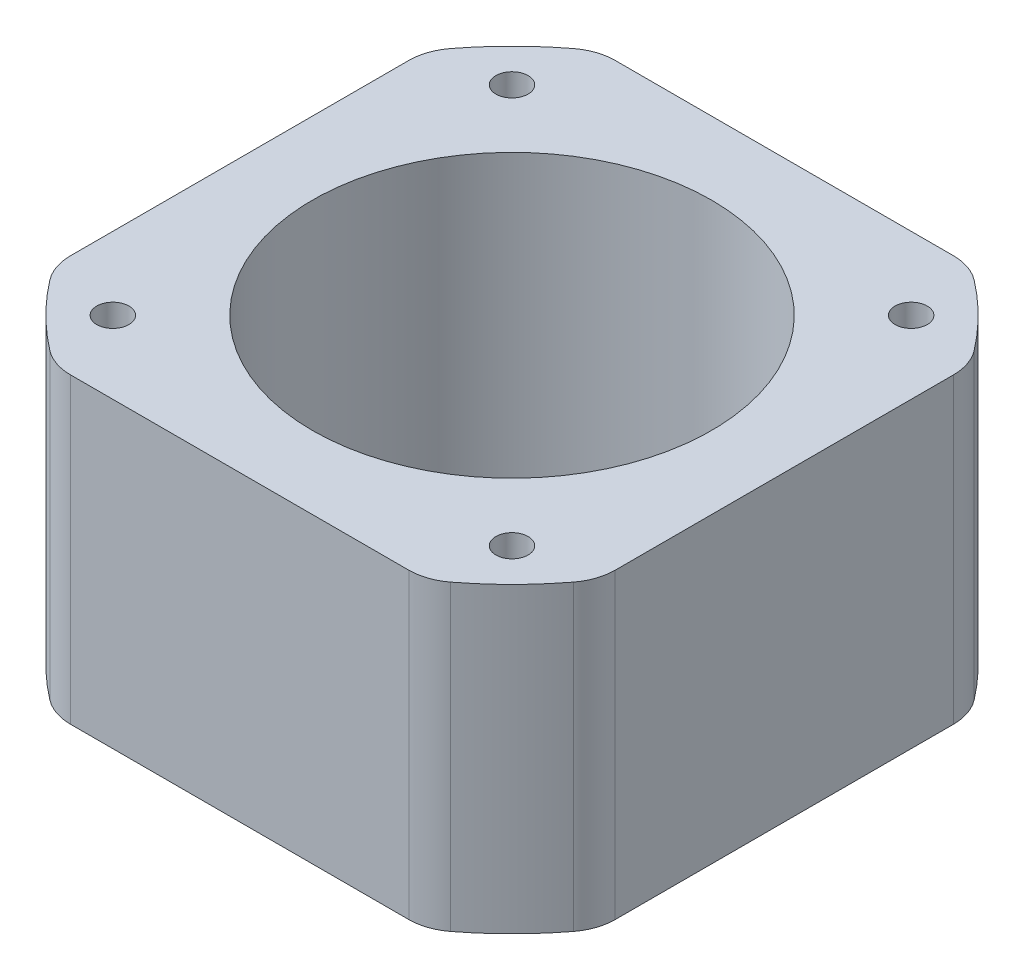
ISO-10303-21;
HEADER;
FILE_DESCRIPTION(('STEP AP214'),'2;1');
FILE_NAME('part.step','',(''),(''),'','','');
FILE_SCHEMA(('AUTOMOTIVE_DESIGN { 1 0 10303 214 1 1 1 1 }'));
ENDSEC;
DATA;
#1=APPLICATION_CONTEXT('core data for automotive mechanical design processes');
#2=APPLICATION_PROTOCOL_DEFINITION('international standard','automotive_design',2000,#1);
#3=PRODUCT_CONTEXT('',#1,'mechanical');
#4=PRODUCT('Part','Part','',(#3));
#5=PRODUCT_RELATED_PRODUCT_CATEGORY('part','',(#4));
#6=PRODUCT_DEFINITION_FORMATION('','',#4);
#7=PRODUCT_DEFINITION_CONTEXT('part definition',#1,'design');
#8=PRODUCT_DEFINITION('design','',#6,#7);
#9=PRODUCT_DEFINITION_SHAPE('','',#8);
#10=(LENGTH_UNIT() NAMED_UNIT(*) SI_UNIT(.MILLI.,.METRE.));
#11=(NAMED_UNIT(*) PLANE_ANGLE_UNIT() SI_UNIT($,.RADIAN.));
#12=(NAMED_UNIT(*) SI_UNIT($,.STERADIAN.) SOLID_ANGLE_UNIT());
#13=UNCERTAINTY_MEASURE_WITH_UNIT(LENGTH_MEASURE(1.E-05),#10,'distance_accuracy_value','');
#14=(GEOMETRIC_REPRESENTATION_CONTEXT(3) GLOBAL_UNCERTAINTY_ASSIGNED_CONTEXT((#13)) GLOBAL_UNIT_ASSIGNED_CONTEXT((#10,
#11,#12)) REPRESENTATION_CONTEXT('',''));
#15=CARTESIAN_POINT('',(0.,0.,0.));
#16=DIRECTION('',(0.,0.,1.));
#17=DIRECTION('',(1.,0.,0.));
#18=AXIS2_PLACEMENT_3D('',#15,#16,#17);
#19=CARTESIAN_POINT('',(0.,23.5,0.));
#20=DIRECTION('',(0.,1.,0.));
#21=DIRECTION('',(0.,0.,1.));
#22=AXIS2_PLACEMENT_3D('',#19,#20,#21);
#23=PLANE('',#22);
#24=CARTESIAN_POINT('',(15.5,23.5,15.5));
#25=DIRECTION('',(0.,1.,0.));
#26=DIRECTION('',(0.,0.,1.));
#27=AXIS2_PLACEMENT_3D('',#24,#25,#26);
#28=CIRCLE('',#27,1.25000000000001);
#29=CARTESIAN_POINT('',(15.5,23.5,16.75));
#30=VERTEX_POINT('',#29);
#31=EDGE_CURVE('E319',#30,#30,#28,.T.);
#32=ORIENTED_EDGE('',*,*,#31,.F.);
#33=EDGE_LOOP('',(#32));
#34=FACE_BOUND('',#33,.T.);
#35=CARTESIAN_POINT('',(-15.5,23.5,-15.5));
#36=DIRECTION('',(0.,1.,0.));
#37=DIRECTION('',(0.,0.,1.));
#38=AXIS2_PLACEMENT_3D('',#35,#36,#37);
#39=CIRCLE('',#38,1.25000000000001);
#40=CARTESIAN_POINT('',(-15.5,23.5,-14.25));
#41=VERTEX_POINT('',#40);
#42=EDGE_CURVE('E307',#41,#41,#39,.T.);
#43=ORIENTED_EDGE('',*,*,#42,.F.);
#44=EDGE_LOOP('',(#43));
#45=FACE_BOUND('',#44,.T.);
#46=CARTESIAN_POINT('',(0.,23.5,0.));
#47=DIRECTION('',(0.,1.,0.));
#48=DIRECTION('',(0.,0.,1.));
#49=AXIS2_PLACEMENT_3D('',#46,#47,#48);
#50=CIRCLE('',#49,25.6);
#51=CARTESIAN_POINT('',(-15.563313761978,23.5,-20.3259259259259));
#52=VERTEX_POINT('',#51);
#53=CARTESIAN_POINT('',(-20.3259259259259,23.5,-15.563313761978));
#54=VERTEX_POINT('',#53);
#55=EDGE_CURVE('E295',#52,#54,#50,.T.);
#56=ORIENTED_EDGE('',*,*,#55,.T.);
#57=CARTESIAN_POINT('',(-17.15,23.5,-13.1315459866689));
#58=DIRECTION('',(0.,1.,0.));
#59=DIRECTION('',(0.,0.,1.));
#60=AXIS2_PLACEMENT_3D('',#57,#58,#59);
#61=CIRCLE('',#60,4.);
#62=CARTESIAN_POINT('',(-21.15,23.5,-13.1315459866689));
#63=VERTEX_POINT('',#62);
#64=EDGE_CURVE('E223',#54,#63,#61,.T.);
#65=ORIENTED_EDGE('',*,*,#64,.T.);
#66=DIRECTION('',(0.,0.,1.));
#67=VECTOR('',#66,1.);
#68=CARTESIAN_POINT('',(-21.15,23.5,14.4235051218489));
#69=LINE('',#68,#67);
#70=CARTESIAN_POINT('',(-21.15,23.5,13.1315459866689));
#71=VERTEX_POINT('',#70);
#72=EDGE_CURVE('E168',#63,#71,#69,.T.);
#73=ORIENTED_EDGE('',*,*,#72,.T.);
#74=CARTESIAN_POINT('',(-17.15,23.5,13.1315459866689));
#75=DIRECTION('',(0.,1.,0.));
#76=DIRECTION('',(0.,0.,1.));
#77=AXIS2_PLACEMENT_3D('',#74,#75,#76);
#78=CIRCLE('',#77,4.);
#79=CARTESIAN_POINT('',(-20.3259259259259,23.5,15.563313761978));
#80=VERTEX_POINT('',#79);
#81=EDGE_CURVE('E210',#71,#80,#78,.T.);
#82=ORIENTED_EDGE('',*,*,#81,.T.);
#83=CARTESIAN_POINT('',(0.,23.5,0.));
#84=DIRECTION('',(0.,1.,0.));
#85=DIRECTION('',(0.,0.,1.));
#86=AXIS2_PLACEMENT_3D('',#83,#84,#85);
#87=CIRCLE('',#86,25.6);
#88=CARTESIAN_POINT('',(-15.563313761978,23.5,20.3259259259259));
#89=VERTEX_POINT('',#88);
#90=EDGE_CURVE('E255',#80,#89,#87,.T.);
#91=ORIENTED_EDGE('',*,*,#90,.T.);
#92=CARTESIAN_POINT('',(-13.1315459866689,23.5,17.15));
#93=DIRECTION('',(0.,1.,0.));
#94=DIRECTION('',(0.,0.,1.));
#95=AXIS2_PLACEMENT_3D('',#92,#93,#94);
#96=CIRCLE('',#95,4.);
#97=CARTESIAN_POINT('',(-13.1315459866689,23.5,21.15));
#98=VERTEX_POINT('',#97);
#99=EDGE_CURVE('E212',#89,#98,#96,.T.);
#100=ORIENTED_EDGE('',*,*,#99,.T.);
#101=DIRECTION('',(1.,0.,0.));
#102=VECTOR('',#101,1.);
#103=CARTESIAN_POINT('',(-14.4235051218489,23.5,21.15));
#104=LINE('',#103,#102);
#105=CARTESIAN_POINT('',(13.1315459866689,23.5,21.15));
#106=VERTEX_POINT('',#105);
#107=EDGE_CURVE('E268',#98,#106,#104,.T.);
#108=ORIENTED_EDGE('',*,*,#107,.T.);
#109=CARTESIAN_POINT('',(13.1315459866689,23.5,17.15));
#110=DIRECTION('',(0.,1.,0.));
#111=DIRECTION('',(0.,0.,1.));
#112=AXIS2_PLACEMENT_3D('',#109,#110,#111);
#113=CIRCLE('',#112,4.);
#114=CARTESIAN_POINT('',(15.563313761978,23.5,20.3259259259259));
#115=VERTEX_POINT('',#114);
#116=EDGE_CURVE('E214',#106,#115,#113,.T.);
#117=ORIENTED_EDGE('',*,*,#116,.T.);
#118=CARTESIAN_POINT('',(0.,23.5,0.));
#119=DIRECTION('',(0.,1.,0.));
#120=DIRECTION('',(0.,0.,1.));
#121=AXIS2_PLACEMENT_3D('',#118,#119,#120);
#122=CIRCLE('',#121,25.6);
#123=CARTESIAN_POINT('',(20.3259259259259,23.5,15.563313761978));
#124=VERTEX_POINT('',#123);
#125=EDGE_CURVE('E270',#115,#124,#122,.T.);
#126=ORIENTED_EDGE('',*,*,#125,.T.);
#127=CARTESIAN_POINT('',(17.15,23.5,13.1315459866689));
#128=DIRECTION('',(0.,1.,0.));
#129=DIRECTION('',(0.,0.,1.));
#130=AXIS2_PLACEMENT_3D('',#127,#128,#129);
#131=CIRCLE('',#130,4.);
#132=CARTESIAN_POINT('',(21.15,23.5,13.1315459866689));
#133=VERTEX_POINT('',#132);
#134=EDGE_CURVE('E56',#124,#133,#131,.T.);
#135=ORIENTED_EDGE('',*,*,#134,.T.);
#136=DIRECTION('',(0.,0.,-1.));
#137=VECTOR('',#136,1.);
#138=CARTESIAN_POINT('',(21.15,23.5,14.4235051218489));
#139=LINE('',#138,#137);
#140=CARTESIAN_POINT('',(21.15,23.5,-13.1315459866689));
#141=VERTEX_POINT('',#140);
#142=EDGE_CURVE('E193',#133,#141,#139,.T.);
#143=ORIENTED_EDGE('',*,*,#142,.T.);
#144=CARTESIAN_POINT('',(17.15,23.5,-13.1315459866689));
#145=DIRECTION('',(0.,1.,0.));
#146=DIRECTION('',(0.,0.,1.));
#147=AXIS2_PLACEMENT_3D('',#144,#145,#146);
#148=CIRCLE('',#147,4.);
#149=CARTESIAN_POINT('',(20.3259259259259,23.5,-15.563313761978));
#150=VERTEX_POINT('',#149);
#151=EDGE_CURVE('E217',#141,#150,#148,.T.);
#152=ORIENTED_EDGE('',*,*,#151,.T.);
#153=CARTESIAN_POINT('',(0.,23.5,0.));
#154=DIRECTION('',(0.,1.,0.));
#155=DIRECTION('',(0.,0.,1.));
#156=AXIS2_PLACEMENT_3D('',#153,#154,#155);
#157=CIRCLE('',#156,25.6);
#158=CARTESIAN_POINT('',(15.563313761978,23.5,-20.3259259259259));
#159=VERTEX_POINT('',#158);
#160=EDGE_CURVE('E192',#150,#159,#157,.T.);
#161=ORIENTED_EDGE('',*,*,#160,.T.);
#162=CARTESIAN_POINT('',(13.1315459866689,23.5,-17.15));
#163=DIRECTION('',(0.,1.,0.));
#164=DIRECTION('',(0.,0.,1.));
#165=AXIS2_PLACEMENT_3D('',#162,#163,#164);
#166=CIRCLE('',#165,4.);
#167=CARTESIAN_POINT('',(13.1315459866689,23.5,-21.15));
#168=VERTEX_POINT('',#167);
#169=EDGE_CURVE('E219',#159,#168,#166,.T.);
#170=ORIENTED_EDGE('',*,*,#169,.T.);
#171=DIRECTION('',(-1.,0.,0.));
#172=VECTOR('',#171,1.);
#173=CARTESIAN_POINT('',(-14.4235051218489,23.5,-21.15));
#174=LINE('',#173,#172);
#175=CARTESIAN_POINT('',(-13.131545986669,23.5,-21.15));
#176=VERTEX_POINT('',#175);
#177=EDGE_CURVE('E296',#168,#176,#174,.T.);
#178=ORIENTED_EDGE('',*,*,#177,.T.);
#179=CARTESIAN_POINT('',(-13.131545986669,23.5,-17.15));
#180=DIRECTION('',(0.,1.,0.));
#181=DIRECTION('',(0.,0.,1.));
#182=AXIS2_PLACEMENT_3D('',#179,#180,#181);
#183=CIRCLE('',#182,4.);
#184=EDGE_CURVE('E221',#176,#52,#183,.T.);
#185=ORIENTED_EDGE('',*,*,#184,.T.);
#186=EDGE_LOOP('',(#56,#65,#73,#82,#91,#100,#108,#117,#126,#135,#143,#152,#161,#170,#178,#185));
#187=FACE_BOUND('',#186,.T.);
#188=CARTESIAN_POINT('',(0.,23.5,0.));
#189=DIRECTION('',(0.,1.,0.));
#190=DIRECTION('',(0.,0.,1.));
#191=AXIS2_PLACEMENT_3D('',#188,#189,#190);
#192=CIRCLE('',#191,15.5);
#193=CARTESIAN_POINT('',(0.,23.5,15.5));
#194=VERTEX_POINT('',#193);
#195=EDGE_CURVE('E279',#194,#194,#192,.T.);
#196=ORIENTED_EDGE('',*,*,#195,.F.);
#197=EDGE_LOOP('',(#196));
#198=FACE_BOUND('',#197,.T.);
#199=CARTESIAN_POINT('',(15.5,23.5,-15.5));
#200=DIRECTION('',(0.,1.,0.));
#201=DIRECTION('',(0.,0.,1.));
#202=AXIS2_PLACEMENT_3D('',#199,#200,#201);
#203=CIRCLE('',#202,1.25000000000001);
#204=CARTESIAN_POINT('',(15.5,23.5,-14.25));
#205=VERTEX_POINT('',#204);
#206=EDGE_CURVE('E313',#205,#205,#203,.T.);
#207=ORIENTED_EDGE('',*,*,#206,.F.);
#208=EDGE_LOOP('',(#207));
#209=FACE_BOUND('',#208,.T.);
#210=CARTESIAN_POINT('',(-15.5,23.5,15.5));
#211=DIRECTION('',(0.,1.,0.));
#212=DIRECTION('',(0.,0.,1.));
#213=AXIS2_PLACEMENT_3D('',#210,#211,#212);
#214=CIRCLE('',#213,1.25000000000001);
#215=CARTESIAN_POINT('',(-15.5,23.5,16.75));
#216=VERTEX_POINT('',#215);
#217=EDGE_CURVE('E325',#216,#216,#214,.T.);
#218=ORIENTED_EDGE('',*,*,#217,.F.);
#219=EDGE_LOOP('',(#218));
#220=FACE_BOUND('',#219,.T.);
#221=ADVANCED_FACE('F34',(#34,#45,#187,#198,#209,#220),#23,.T.);
#222=CARTESIAN_POINT('',(0.,0.,0.));
#223=DIRECTION('',(0.,1.,0.));
#224=DIRECTION('',(0.,0.,1.));
#225=AXIS2_PLACEMENT_3D('',#222,#223,#224);
#226=PLANE('',#225);
#227=CARTESIAN_POINT('',(15.5,0.,15.5));
#228=DIRECTION('',(0.,1.,0.));
#229=DIRECTION('',(0.,0.,1.));
#230=AXIS2_PLACEMENT_3D('',#227,#228,#229);
#231=CIRCLE('',#230,1.25000000000001);
#232=CARTESIAN_POINT('',(15.5,0.,16.75));
#233=VERTEX_POINT('',#232);
#234=EDGE_CURVE('E322',#233,#233,#231,.T.);
#235=ORIENTED_EDGE('',*,*,#234,.T.);
#236=EDGE_LOOP('',(#235));
#237=FACE_BOUND('',#236,.T.);
#238=CARTESIAN_POINT('',(-15.5,0.,-15.5));
#239=DIRECTION('',(0.,1.,0.));
#240=DIRECTION('',(0.,0.,1.));
#241=AXIS2_PLACEMENT_3D('',#238,#239,#240);
#242=CIRCLE('',#241,1.25000000000001);
#243=CARTESIAN_POINT('',(-15.5,0.,-14.25));
#244=VERTEX_POINT('',#243);
#245=EDGE_CURVE('E310',#244,#244,#242,.T.);
#246=ORIENTED_EDGE('',*,*,#245,.T.);
#247=EDGE_LOOP('',(#246));
#248=FACE_BOUND('',#247,.T.);
#249=DIRECTION('',(0.,0.,1.));
#250=VECTOR('',#249,1.);
#251=CARTESIAN_POINT('',(-21.15,0.,14.4235051218489));
#252=LINE('',#251,#250);
#253=CARTESIAN_POINT('',(-21.15,0.,-13.1315459866689));
#254=VERTEX_POINT('',#253);
#255=CARTESIAN_POINT('',(-21.15,0.,13.1315459866689));
#256=VERTEX_POINT('',#255);
#257=EDGE_CURVE('E165',#254,#256,#252,.T.);
#258=ORIENTED_EDGE('',*,*,#257,.F.);
#259=CARTESIAN_POINT('',(-17.15,0.,-13.1315459866689));
#260=DIRECTION('',(0.,1.,0.));
#261=DIRECTION('',(0.,0.,1.));
#262=AXIS2_PLACEMENT_3D('',#259,#260,#261);
#263=CIRCLE('',#262,4.);
#264=CARTESIAN_POINT('',(-20.3259259259259,0.,-15.563313761978));
#265=VERTEX_POINT('',#264);
#266=EDGE_CURVE('E148',#254,#265,#263,.F.);
#267=ORIENTED_EDGE('',*,*,#266,.T.);
#268=CARTESIAN_POINT('',(0.,0.,0.));
#269=DIRECTION('',(0.,1.,0.));
#270=DIRECTION('',(0.,0.,1.));
#271=AXIS2_PLACEMENT_3D('',#268,#269,#270);
#272=CIRCLE('',#271,25.6);
#273=CARTESIAN_POINT('',(-15.563313761978,0.,-20.3259259259259));
#274=VERTEX_POINT('',#273);
#275=EDGE_CURVE('E176',#274,#265,#272,.T.);
#276=ORIENTED_EDGE('',*,*,#275,.F.);
#277=CARTESIAN_POINT('',(-13.131545986669,0.,-17.15));
#278=DIRECTION('',(0.,1.,0.));
#279=DIRECTION('',(0.,0.,1.));
#280=AXIS2_PLACEMENT_3D('',#277,#278,#279);
#281=CIRCLE('',#280,4.);
#282=CARTESIAN_POINT('',(-13.131545986669,0.,-21.15));
#283=VERTEX_POINT('',#282);
#284=EDGE_CURVE('E159',#274,#283,#281,.F.);
#285=ORIENTED_EDGE('',*,*,#284,.T.);
#286=DIRECTION('',(-1.,0.,0.));
#287=VECTOR('',#286,1.);
#288=CARTESIAN_POINT('',(-14.4235051218489,0.,-21.15));
#289=LINE('',#288,#287);
#290=CARTESIAN_POINT('',(13.1315459866689,0.,-21.15));
#291=VERTEX_POINT('',#290);
#292=EDGE_CURVE('E181',#291,#283,#289,.T.);
#293=ORIENTED_EDGE('',*,*,#292,.F.);
#294=CARTESIAN_POINT('',(13.1315459866689,0.,-17.15));
#295=DIRECTION('',(0.,1.,0.));
#296=DIRECTION('',(0.,0.,1.));
#297=AXIS2_PLACEMENT_3D('',#294,#295,#296);
#298=CIRCLE('',#297,4.);
#299=CARTESIAN_POINT('',(15.563313761978,0.,-20.3259259259259));
#300=VERTEX_POINT('',#299);
#301=EDGE_CURVE('E204',#291,#300,#298,.F.);
#302=ORIENTED_EDGE('',*,*,#301,.T.);
#303=CARTESIAN_POINT('',(0.,0.,0.));
#304=DIRECTION('',(0.,1.,0.));
#305=DIRECTION('',(0.,0.,1.));
#306=AXIS2_PLACEMENT_3D('',#303,#304,#305);
#307=CIRCLE('',#306,25.6);
#308=CARTESIAN_POINT('',(20.3259259259259,0.,-15.563313761978));
#309=VERTEX_POINT('',#308);
#310=EDGE_CURVE('E277',#309,#300,#307,.T.);
#311=ORIENTED_EDGE('',*,*,#310,.F.);
#312=CARTESIAN_POINT('',(17.15,0.,-13.1315459866689));
#313=DIRECTION('',(0.,1.,0.));
#314=DIRECTION('',(0.,0.,1.));
#315=AXIS2_PLACEMENT_3D('',#312,#313,#314);
#316=CIRCLE('',#315,4.);
#317=CARTESIAN_POINT('',(21.15,0.,-13.1315459866689));
#318=VERTEX_POINT('',#317);
#319=EDGE_CURVE('E202',#309,#318,#316,.F.);
#320=ORIENTED_EDGE('',*,*,#319,.T.);
#321=DIRECTION('',(0.,0.,-1.));
#322=VECTOR('',#321,1.);
#323=CARTESIAN_POINT('',(21.15,0.,14.4235051218489));
#324=LINE('',#323,#322);
#325=CARTESIAN_POINT('',(21.15,0.,13.1315459866689));
#326=VERTEX_POINT('',#325);
#327=EDGE_CURVE('E190',#326,#318,#324,.T.);
#328=ORIENTED_EDGE('',*,*,#327,.F.);
#329=CARTESIAN_POINT('',(17.15,0.,13.1315459866689));
#330=DIRECTION('',(0.,1.,0.));
#331=DIRECTION('',(0.,0.,1.));
#332=AXIS2_PLACEMENT_3D('',#329,#330,#331);
#333=CIRCLE('',#332,4.);
#334=CARTESIAN_POINT('',(20.3259259259259,0.,15.563313761978));
#335=VERTEX_POINT('',#334);
#336=EDGE_CURVE('E200',#326,#335,#333,.F.);
#337=ORIENTED_EDGE('',*,*,#336,.T.);
#338=CARTESIAN_POINT('',(0.,0.,0.));
#339=DIRECTION('',(0.,1.,0.));
#340=DIRECTION('',(0.,0.,1.));
#341=AXIS2_PLACEMENT_3D('',#338,#339,#340);
#342=CIRCLE('',#341,25.6);
#343=CARTESIAN_POINT('',(15.563313761978,0.,20.3259259259259));
#344=VERTEX_POINT('',#343);
#345=EDGE_CURVE('E187',#344,#335,#342,.T.);
#346=ORIENTED_EDGE('',*,*,#345,.F.);
#347=CARTESIAN_POINT('',(13.1315459866689,0.,17.15));
#348=DIRECTION('',(0.,1.,0.));
#349=DIRECTION('',(0.,0.,1.));
#350=AXIS2_PLACEMENT_3D('',#347,#348,#349);
#351=CIRCLE('',#350,4.);
#352=CARTESIAN_POINT('',(13.1315459866689,0.,21.15));
#353=VERTEX_POINT('',#352);
#354=EDGE_CURVE('E198',#344,#353,#351,.F.);
#355=ORIENTED_EDGE('',*,*,#354,.T.);
#356=DIRECTION('',(1.,0.,0.));
#357=VECTOR('',#356,1.);
#358=CARTESIAN_POINT('',(-14.4235051218489,0.,21.15));
#359=LINE('',#358,#357);
#360=CARTESIAN_POINT('',(-13.1315459866689,0.,21.15));
#361=VERTEX_POINT('',#360);
#362=EDGE_CURVE('E179',#361,#353,#359,.T.);
#363=ORIENTED_EDGE('',*,*,#362,.F.);
#364=CARTESIAN_POINT('',(-13.1315459866689,0.,17.15));
#365=DIRECTION('',(0.,1.,0.));
#366=DIRECTION('',(0.,0.,1.));
#367=AXIS2_PLACEMENT_3D('',#364,#365,#366);
#368=CIRCLE('',#367,4.);
#369=CARTESIAN_POINT('',(-15.563313761978,0.,20.3259259259259));
#370=VERTEX_POINT('',#369);
#371=EDGE_CURVE('E196',#361,#370,#368,.F.);
#372=ORIENTED_EDGE('',*,*,#371,.T.);
#373=CARTESIAN_POINT('',(0.,0.,0.));
#374=DIRECTION('',(0.,1.,0.));
#375=DIRECTION('',(0.,0.,1.));
#376=AXIS2_PLACEMENT_3D('',#373,#374,#375);
#377=CIRCLE('',#376,25.6);
#378=CARTESIAN_POINT('',(-20.3259259259259,0.,15.563313761978));
#379=VERTEX_POINT('',#378);
#380=EDGE_CURVE('E175',#379,#370,#377,.T.);
#381=ORIENTED_EDGE('',*,*,#380,.F.);
#382=CARTESIAN_POINT('',(-17.15,0.,13.1315459866689));
#383=DIRECTION('',(0.,1.,0.));
#384=DIRECTION('',(0.,0.,1.));
#385=AXIS2_PLACEMENT_3D('',#382,#383,#384);
#386=CIRCLE('',#385,4.);
#387=EDGE_CURVE('E169',#379,#256,#386,.F.);
#388=ORIENTED_EDGE('',*,*,#387,.T.);
#389=EDGE_LOOP('',(#258,#267,#276,#285,#293,#302,#311,#320,#328,#337,#346,#355,#363,#372,#381,#388));
#390=FACE_BOUND('',#389,.T.);
#391=CARTESIAN_POINT('',(0.,0.,0.));
#392=DIRECTION('',(0.,1.,0.));
#393=DIRECTION('',(0.,0.,1.));
#394=AXIS2_PLACEMENT_3D('',#391,#392,#393);
#395=CIRCLE('',#394,15.5);
#396=CARTESIAN_POINT('',(0.,0.,15.5));
#397=VERTEX_POINT('',#396);
#398=EDGE_CURVE('E304',#397,#397,#395,.T.);
#399=ORIENTED_EDGE('',*,*,#398,.T.);
#400=EDGE_LOOP('',(#399));
#401=FACE_BOUND('',#400,.T.);
#402=CARTESIAN_POINT('',(15.5,0.,-15.5));
#403=DIRECTION('',(0.,1.,0.));
#404=DIRECTION('',(0.,0.,1.));
#405=AXIS2_PLACEMENT_3D('',#402,#403,#404);
#406=CIRCLE('',#405,1.25000000000001);
#407=CARTESIAN_POINT('',(15.5,0.,-14.25));
#408=VERTEX_POINT('',#407);
#409=EDGE_CURVE('E316',#408,#408,#406,.T.);
#410=ORIENTED_EDGE('',*,*,#409,.T.);
#411=EDGE_LOOP('',(#410));
#412=FACE_BOUND('',#411,.T.);
#413=CARTESIAN_POINT('',(-15.5,0.,15.5));
#414=DIRECTION('',(0.,1.,0.));
#415=DIRECTION('',(0.,0.,1.));
#416=AXIS2_PLACEMENT_3D('',#413,#414,#415);
#417=CIRCLE('',#416,1.25000000000001);
#418=CARTESIAN_POINT('',(-15.5,0.,16.75));
#419=VERTEX_POINT('',#418);
#420=EDGE_CURVE('E328',#419,#419,#417,.T.);
#421=ORIENTED_EDGE('',*,*,#420,.T.);
#422=EDGE_LOOP('',(#421));
#423=FACE_BOUND('',#422,.T.);
#424=ADVANCED_FACE('F172',(#237,#248,#390,#401,#412,#423),#226,.F.);
#425=CARTESIAN_POINT('',(0.,23.5,0.));
#426=DIRECTION('',(0.,-1.,0.));
#427=DIRECTION('',(0.,0.,-1.));
#428=AXIS2_PLACEMENT_3D('',#425,#426,#427);
#429=CYLINDRICAL_SURFACE('',#428,25.6);
#430=ORIENTED_EDGE('',*,*,#310,.T.);
#431=DIRECTION('',(0.,-1.,0.));
#432=VECTOR('',#431,1.);
#433=CARTESIAN_POINT('',(15.563313761978,23.5,-20.3259259259259));
#434=LINE('',#433,#432);
#435=EDGE_CURVE('E233',#300,#159,#434,.F.);
#436=ORIENTED_EDGE('',*,*,#435,.T.);
#437=ORIENTED_EDGE('',*,*,#160,.F.);
#438=DIRECTION('',(0.,-1.,0.));
#439=VECTOR('',#438,1.);
#440=CARTESIAN_POINT('',(20.3259259259259,23.5,-15.563313761978));
#441=LINE('',#440,#439);
#442=EDGE_CURVE('E230',#150,#309,#441,.T.);
#443=ORIENTED_EDGE('',*,*,#442,.T.);
#444=EDGE_LOOP('',(#430,#436,#437,#443));
#445=FACE_BOUND('',#444,.T.);
#446=ADVANCED_FACE('F343',(#445),#429,.T.);
#447=CARTESIAN_POINT('',(-14.4235051218489,23.5,-21.15));
#448=DIRECTION('',(0.,0.,1.));
#449=DIRECTION('',(1.,0.,0.));
#450=AXIS2_PLACEMENT_3D('',#447,#448,#449);
#451=PLANE('',#450);
#452=ORIENTED_EDGE('',*,*,#292,.T.);
#453=DIRECTION('',(0.,-1.,0.));
#454=VECTOR('',#453,1.);
#455=CARTESIAN_POINT('',(-13.131545986669,23.5,-21.15));
#456=LINE('',#455,#454);
#457=EDGE_CURVE('E228',#283,#176,#456,.F.);
#458=ORIENTED_EDGE('',*,*,#457,.T.);
#459=ORIENTED_EDGE('',*,*,#177,.F.);
#460=DIRECTION('',(0.,-1.,0.));
#461=VECTOR('',#460,1.);
#462=CARTESIAN_POINT('',(13.1315459866689,23.5,-21.15));
#463=LINE('',#462,#461);
#464=EDGE_CURVE('E225',#168,#291,#463,.T.);
#465=ORIENTED_EDGE('',*,*,#464,.T.);
#466=EDGE_LOOP('',(#452,#458,#459,#465));
#467=FACE_BOUND('',#466,.T.);
#468=ADVANCED_FACE('F284',(#467),#451,.F.);
#469=CARTESIAN_POINT('',(0.,23.5,0.));
#470=DIRECTION('',(0.,-1.,0.));
#471=DIRECTION('',(0.,0.,-1.));
#472=AXIS2_PLACEMENT_3D('',#469,#470,#471);
#473=CYLINDRICAL_SURFACE('',#472,25.6);
#474=ORIENTED_EDGE('',*,*,#275,.T.);
#475=DIRECTION('',(0.,-1.,0.));
#476=VECTOR('',#475,1.);
#477=CARTESIAN_POINT('',(-20.3259259259259,23.5,-15.563313761978));
#478=LINE('',#477,#476);
#479=EDGE_CURVE('E153',#265,#54,#478,.F.);
#480=ORIENTED_EDGE('',*,*,#479,.T.);
#481=ORIENTED_EDGE('',*,*,#55,.F.);
#482=DIRECTION('',(0.,-1.,0.));
#483=VECTOR('',#482,1.);
#484=CARTESIAN_POINT('',(-15.563313761978,23.5,-20.3259259259259));
#485=LINE('',#484,#483);
#486=EDGE_CURVE('E158',#52,#274,#485,.T.);
#487=ORIENTED_EDGE('',*,*,#486,.T.);
#488=EDGE_LOOP('',(#474,#480,#481,#487));
#489=FACE_BOUND('',#488,.T.);
#490=ADVANCED_FACE('F298',(#489),#473,.T.);
#491=CARTESIAN_POINT('',(-21.15,23.5,14.4235051218489));
#492=DIRECTION('',(1.,0.,0.));
#493=DIRECTION('',(0.,0.,-1.));
#494=AXIS2_PLACEMENT_3D('',#491,#492,#493);
#495=PLANE('',#494);
#496=ORIENTED_EDGE('',*,*,#72,.F.);
#497=DIRECTION('',(0.,-1.,0.));
#498=VECTOR('',#497,1.);
#499=CARTESIAN_POINT('',(-21.15,23.5,-13.1315459866689));
#500=LINE('',#499,#498);
#501=EDGE_CURVE('E152',#63,#254,#500,.T.);
#502=ORIENTED_EDGE('',*,*,#501,.T.);
#503=ORIENTED_EDGE('',*,*,#257,.T.);
#504=DIRECTION('',(0.,-1.,0.));
#505=VECTOR('',#504,1.);
#506=CARTESIAN_POINT('',(-21.15,23.5,13.1315459866689));
#507=LINE('',#506,#505);
#508=EDGE_CURVE('E170',#256,#71,#507,.F.);
#509=ORIENTED_EDGE('',*,*,#508,.T.);
#510=EDGE_LOOP('',(#496,#502,#503,#509));
#511=FACE_BOUND('',#510,.T.);
#512=ADVANCED_FACE('F164',(#511),#495,.F.);
#513=CARTESIAN_POINT('',(0.,23.5,0.));
#514=DIRECTION('',(0.,-1.,0.));
#515=DIRECTION('',(0.,0.,-1.));
#516=AXIS2_PLACEMENT_3D('',#513,#514,#515);
#517=CYLINDRICAL_SURFACE('',#516,25.6);
#518=ORIENTED_EDGE('',*,*,#380,.T.);
#519=DIRECTION('',(0.,-1.,0.));
#520=VECTOR('',#519,1.);
#521=CARTESIAN_POINT('',(-15.563313761978,23.5,20.3259259259259));
#522=LINE('',#521,#520);
#523=EDGE_CURVE('E11',#370,#89,#522,.F.);
#524=ORIENTED_EDGE('',*,*,#523,.T.);
#525=ORIENTED_EDGE('',*,*,#90,.F.);
#526=DIRECTION('',(0.,-1.,0.));
#527=VECTOR('',#526,1.);
#528=CARTESIAN_POINT('',(-20.3259259259259,23.5,15.563313761978));
#529=LINE('',#528,#527);
#530=EDGE_CURVE('E42',#80,#379,#529,.T.);
#531=ORIENTED_EDGE('',*,*,#530,.T.);
#532=EDGE_LOOP('',(#518,#524,#525,#531));
#533=FACE_BOUND('',#532,.T.);
#534=ADVANCED_FACE('F252',(#533),#517,.T.);
#535=CARTESIAN_POINT('',(-14.4235051218489,23.5,21.15));
#536=DIRECTION('',(0.,0.,-1.));
#537=DIRECTION('',(-1.,0.,0.));
#538=AXIS2_PLACEMENT_3D('',#535,#536,#537);
#539=PLANE('',#538);
#540=ORIENTED_EDGE('',*,*,#362,.T.);
#541=DIRECTION('',(0.,-1.,0.));
#542=VECTOR('',#541,1.);
#543=CARTESIAN_POINT('',(13.1315459866689,23.5,21.15));
#544=LINE('',#543,#542);
#545=EDGE_CURVE('E247',#353,#106,#544,.F.);
#546=ORIENTED_EDGE('',*,*,#545,.T.);
#547=ORIENTED_EDGE('',*,*,#107,.F.);
#548=DIRECTION('',(0.,-1.,0.));
#549=VECTOR('',#548,1.);
#550=CARTESIAN_POINT('',(-13.1315459866689,23.5,21.15));
#551=LINE('',#550,#549);
#552=EDGE_CURVE('E244',#98,#361,#551,.T.);
#553=ORIENTED_EDGE('',*,*,#552,.T.);
#554=EDGE_LOOP('',(#540,#546,#547,#553));
#555=FACE_BOUND('',#554,.T.);
#556=ADVANCED_FACE('F265',(#555),#539,.F.);
#557=CARTESIAN_POINT('',(0.,23.5,0.));
#558=DIRECTION('',(0.,-1.,0.));
#559=DIRECTION('',(0.,0.,-1.));
#560=AXIS2_PLACEMENT_3D('',#557,#558,#559);
#561=CYLINDRICAL_SURFACE('',#560,25.6);
#562=ORIENTED_EDGE('',*,*,#345,.T.);
#563=DIRECTION('',(0.,-1.,0.));
#564=VECTOR('',#563,1.);
#565=CARTESIAN_POINT('',(20.3259259259259,23.5,15.563313761978));
#566=LINE('',#565,#564);
#567=EDGE_CURVE('E242',#335,#124,#566,.F.);
#568=ORIENTED_EDGE('',*,*,#567,.T.);
#569=ORIENTED_EDGE('',*,*,#125,.F.);
#570=DIRECTION('',(0.,-1.,0.));
#571=VECTOR('',#570,1.);
#572=CARTESIAN_POINT('',(15.563313761978,23.5,20.3259259259259));
#573=LINE('',#572,#571);
#574=EDGE_CURVE('E239',#115,#344,#573,.T.);
#575=ORIENTED_EDGE('',*,*,#574,.T.);
#576=EDGE_LOOP('',(#562,#568,#569,#575));
#577=FACE_BOUND('',#576,.T.);
#578=ADVANCED_FACE('F355',(#577),#561,.T.);
#579=CARTESIAN_POINT('',(21.15,23.5,14.4235051218489));
#580=DIRECTION('',(-1.,0.,0.));
#581=DIRECTION('',(0.,0.,1.));
#582=AXIS2_PLACEMENT_3D('',#579,#580,#581);
#583=PLANE('',#582);
#584=ORIENTED_EDGE('',*,*,#327,.T.);
#585=DIRECTION('',(0.,-1.,0.));
#586=VECTOR('',#585,1.);
#587=CARTESIAN_POINT('',(21.15,23.5,-13.1315459866689));
#588=LINE('',#587,#586);
#589=EDGE_CURVE('E49',#318,#141,#588,.F.);
#590=ORIENTED_EDGE('',*,*,#589,.T.);
#591=ORIENTED_EDGE('',*,*,#142,.F.);
#592=DIRECTION('',(0.,-1.,0.));
#593=VECTOR('',#592,1.);
#594=CARTESIAN_POINT('',(21.15,23.5,13.1315459866689));
#595=LINE('',#594,#593);
#596=EDGE_CURVE('E235',#133,#326,#595,.T.);
#597=ORIENTED_EDGE('',*,*,#596,.T.);
#598=EDGE_LOOP('',(#584,#590,#591,#597));
#599=FACE_BOUND('',#598,.T.);
#600=ADVANCED_FACE('F352',(#599),#583,.F.);
#601=CARTESIAN_POINT('',(0.,23.5,0.));
#602=DIRECTION('',(0.,-1.,0.));
#603=DIRECTION('',(0.,0.,-1.));
#604=AXIS2_PLACEMENT_3D('',#601,#602,#603);
#605=CYLINDRICAL_SURFACE('',#604,15.5);
#606=ORIENTED_EDGE('',*,*,#195,.T.);
#607=EDGE_LOOP('',(#606));
#608=FACE_BOUND('',#607,.T.);
#609=ORIENTED_EDGE('',*,*,#398,.F.);
#610=EDGE_LOOP('',(#609));
#611=FACE_BOUND('',#610,.T.);
#612=ADVANCED_FACE('F349',(#608,#611),#605,.F.);
#613=CARTESIAN_POINT('',(-15.5,23.5,-15.5));
#614=DIRECTION('',(0.,-1.,0.));
#615=DIRECTION('',(0.,0.,-1.));
#616=AXIS2_PLACEMENT_3D('',#613,#614,#615);
#617=CYLINDRICAL_SURFACE('',#616,1.25000000000001);
#618=ORIENTED_EDGE('',*,*,#42,.T.);
#619=EDGE_LOOP('',(#618));
#620=FACE_BOUND('',#619,.T.);
#621=ORIENTED_EDGE('',*,*,#245,.F.);
#622=EDGE_LOOP('',(#621));
#623=FACE_BOUND('',#622,.T.);
#624=ADVANCED_FACE('F525',(#620,#623),#617,.F.);
#625=CARTESIAN_POINT('',(15.5,23.5,-15.5));
#626=DIRECTION('',(0.,-1.,0.));
#627=DIRECTION('',(0.,0.,-1.));
#628=AXIS2_PLACEMENT_3D('',#625,#626,#627);
#629=CYLINDRICAL_SURFACE('',#628,1.25000000000001);
#630=ORIENTED_EDGE('',*,*,#206,.T.);
#631=EDGE_LOOP('',(#630));
#632=FACE_BOUND('',#631,.T.);
#633=ORIENTED_EDGE('',*,*,#409,.F.);
#634=EDGE_LOOP('',(#633));
#635=FACE_BOUND('',#634,.T.);
#636=ADVANCED_FACE('F515',(#632,#635),#629,.F.);
#637=CARTESIAN_POINT('',(15.5,23.5,15.5));
#638=DIRECTION('',(0.,-1.,0.));
#639=DIRECTION('',(0.,0.,-1.));
#640=AXIS2_PLACEMENT_3D('',#637,#638,#639);
#641=CYLINDRICAL_SURFACE('',#640,1.25000000000001);
#642=ORIENTED_EDGE('',*,*,#31,.T.);
#643=EDGE_LOOP('',(#642));
#644=FACE_BOUND('',#643,.T.);
#645=ORIENTED_EDGE('',*,*,#234,.F.);
#646=EDGE_LOOP('',(#645));
#647=FACE_BOUND('',#646,.T.);
#648=ADVANCED_FACE('F506',(#644,#647),#641,.F.);
#649=CARTESIAN_POINT('',(-15.5,23.5,15.5));
#650=DIRECTION('',(0.,-1.,0.));
#651=DIRECTION('',(0.,0.,-1.));
#652=AXIS2_PLACEMENT_3D('',#649,#650,#651);
#653=CYLINDRICAL_SURFACE('',#652,1.25000000000001);
#654=ORIENTED_EDGE('',*,*,#217,.T.);
#655=EDGE_LOOP('',(#654));
#656=FACE_BOUND('',#655,.T.);
#657=ORIENTED_EDGE('',*,*,#420,.F.);
#658=EDGE_LOOP('',(#657));
#659=FACE_BOUND('',#658,.T.);
#660=ADVANCED_FACE('F334',(#656,#659),#653,.F.);
#661=CARTESIAN_POINT('',(-17.15,23.5,-13.1315459866689));
#662=DIRECTION('',(0.,-1.,0.));
#663=DIRECTION('',(0.,0.,-1.));
#664=AXIS2_PLACEMENT_3D('',#661,#662,#663);
#665=CYLINDRICAL_SURFACE('',#664,4.);
#666=ORIENTED_EDGE('',*,*,#64,.F.);
#667=ORIENTED_EDGE('',*,*,#479,.F.);
#668=ORIENTED_EDGE('',*,*,#266,.F.);
#669=ORIENTED_EDGE('',*,*,#501,.F.);
#670=EDGE_LOOP('',(#666,#667,#668,#669));
#671=FACE_BOUND('',#670,.T.);
#672=ADVANCED_FACE('F151',(#671),#665,.T.);
#673=CARTESIAN_POINT('',(-13.131545986669,23.5,-17.15));
#674=DIRECTION('',(0.,-1.,0.));
#675=DIRECTION('',(0.,0.,-1.));
#676=AXIS2_PLACEMENT_3D('',#673,#674,#675);
#677=CYLINDRICAL_SURFACE('',#676,4.);
#678=ORIENTED_EDGE('',*,*,#184,.F.);
#679=ORIENTED_EDGE('',*,*,#457,.F.);
#680=ORIENTED_EDGE('',*,*,#284,.F.);
#681=ORIENTED_EDGE('',*,*,#486,.F.);
#682=EDGE_LOOP('',(#678,#679,#680,#681));
#683=FACE_BOUND('',#682,.T.);
#684=ADVANCED_FACE('F290',(#683),#677,.T.);
#685=CARTESIAN_POINT('',(13.1315459866689,23.5,-17.15));
#686=DIRECTION('',(0.,-1.,0.));
#687=DIRECTION('',(0.,0.,-1.));
#688=AXIS2_PLACEMENT_3D('',#685,#686,#687);
#689=CYLINDRICAL_SURFACE('',#688,4.);
#690=ORIENTED_EDGE('',*,*,#169,.F.);
#691=ORIENTED_EDGE('',*,*,#435,.F.);
#692=ORIENTED_EDGE('',*,*,#301,.F.);
#693=ORIENTED_EDGE('',*,*,#464,.F.);
#694=EDGE_LOOP('',(#690,#691,#692,#693));
#695=FACE_BOUND('',#694,.T.);
#696=ADVANCED_FACE('F376',(#695),#689,.T.);
#697=CARTESIAN_POINT('',(17.15,23.5,-13.1315459866689));
#698=DIRECTION('',(0.,-1.,0.));
#699=DIRECTION('',(0.,0.,-1.));
#700=AXIS2_PLACEMENT_3D('',#697,#698,#699);
#701=CYLINDRICAL_SURFACE('',#700,4.);
#702=ORIENTED_EDGE('',*,*,#151,.F.);
#703=ORIENTED_EDGE('',*,*,#589,.F.);
#704=ORIENTED_EDGE('',*,*,#319,.F.);
#705=ORIENTED_EDGE('',*,*,#442,.F.);
#706=EDGE_LOOP('',(#702,#703,#704,#705));
#707=FACE_BOUND('',#706,.T.);
#708=ADVANCED_FACE('F379',(#707),#701,.T.);
#709=CARTESIAN_POINT('',(17.15,23.5,13.1315459866689));
#710=DIRECTION('',(0.,-1.,0.));
#711=DIRECTION('',(0.,0.,-1.));
#712=AXIS2_PLACEMENT_3D('',#709,#710,#711);
#713=CYLINDRICAL_SURFACE('',#712,4.);
#714=ORIENTED_EDGE('',*,*,#134,.F.);
#715=ORIENTED_EDGE('',*,*,#567,.F.);
#716=ORIENTED_EDGE('',*,*,#336,.F.);
#717=ORIENTED_EDGE('',*,*,#596,.F.);
#718=EDGE_LOOP('',(#714,#715,#716,#717));
#719=FACE_BOUND('',#718,.T.);
#720=ADVANCED_FACE('F383',(#719),#713,.T.);
#721=CARTESIAN_POINT('',(13.1315459866689,23.5,17.15));
#722=DIRECTION('',(0.,-1.,0.));
#723=DIRECTION('',(0.,0.,-1.));
#724=AXIS2_PLACEMENT_3D('',#721,#722,#723);
#725=CYLINDRICAL_SURFACE('',#724,4.);
#726=ORIENTED_EDGE('',*,*,#116,.F.);
#727=ORIENTED_EDGE('',*,*,#545,.F.);
#728=ORIENTED_EDGE('',*,*,#354,.F.);
#729=ORIENTED_EDGE('',*,*,#574,.F.);
#730=EDGE_LOOP('',(#726,#727,#728,#729));
#731=FACE_BOUND('',#730,.T.);
#732=ADVANCED_FACE('F387',(#731),#725,.T.);
#733=CARTESIAN_POINT('',(-13.1315459866689,23.5,17.15));
#734=DIRECTION('',(0.,-1.,0.));
#735=DIRECTION('',(0.,0.,-1.));
#736=AXIS2_PLACEMENT_3D('',#733,#734,#735);
#737=CYLINDRICAL_SURFACE('',#736,4.);
#738=ORIENTED_EDGE('',*,*,#99,.F.);
#739=ORIENTED_EDGE('',*,*,#523,.F.);
#740=ORIENTED_EDGE('',*,*,#371,.F.);
#741=ORIENTED_EDGE('',*,*,#552,.F.);
#742=EDGE_LOOP('',(#738,#739,#740,#741));
#743=FACE_BOUND('',#742,.T.);
#744=ADVANCED_FACE('F262',(#743),#737,.T.);
#745=CARTESIAN_POINT('',(-17.15,23.5,13.1315459866689));
#746=DIRECTION('',(0.,-1.,0.));
#747=DIRECTION('',(0.,0.,-1.));
#748=AXIS2_PLACEMENT_3D('',#745,#746,#747);
#749=CYLINDRICAL_SURFACE('',#748,4.);
#750=ORIENTED_EDGE('',*,*,#81,.F.);
#751=ORIENTED_EDGE('',*,*,#508,.F.);
#752=ORIENTED_EDGE('',*,*,#387,.F.);
#753=ORIENTED_EDGE('',*,*,#530,.F.);
#754=EDGE_LOOP('',(#750,#751,#752,#753));
#755=FACE_BOUND('',#754,.T.);
#756=ADVANCED_FACE('F36',(#755),#749,.T.);
#757=CLOSED_SHELL('',(#221,#424,#446,#468,#490,#512,#534,#556,#578,#600,#612,#624,#636,#648,
#660,#672,#684,#696,#708,#720,#732,#744,#756));
#758=MANIFOLD_SOLID_BREP('B2',#757);
#759=ADVANCED_BREP_SHAPE_REPRESENTATION('',(#18,#758),#14);
#760=SHAPE_DEFINITION_REPRESENTATION(#9,#759);
ENDSEC;
END-ISO-10303-21;
